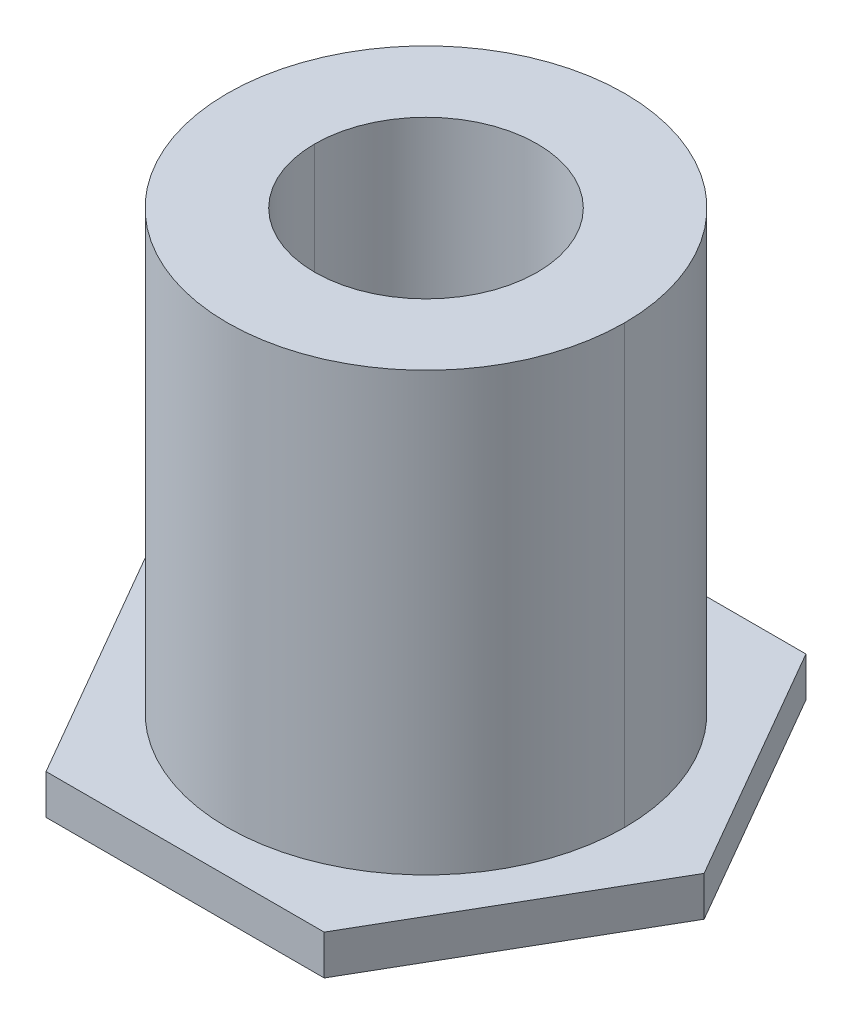
ISO-10303-21;
HEADER;
FILE_DESCRIPTION(('STEP AP214'),'2;1');
FILE_NAME('part.step','',(''),(''),'','','');
FILE_SCHEMA(('AUTOMOTIVE_DESIGN { 1 0 10303 214 1 1 1 1 }'));
ENDSEC;
DATA;
#1=APPLICATION_CONTEXT('core data for automotive mechanical design processes');
#2=APPLICATION_PROTOCOL_DEFINITION('international standard','automotive_design',2000,#1);
#3=PRODUCT_CONTEXT('',#1,'mechanical');
#4=PRODUCT('Part','Part','',(#3));
#5=PRODUCT_RELATED_PRODUCT_CATEGORY('part','',(#4));
#6=PRODUCT_DEFINITION_FORMATION('','',#4);
#7=PRODUCT_DEFINITION_CONTEXT('part definition',#1,'design');
#8=PRODUCT_DEFINITION('design','',#6,#7);
#9=PRODUCT_DEFINITION_SHAPE('','',#8);
#10=(LENGTH_UNIT() NAMED_UNIT(*) SI_UNIT(.MILLI.,.METRE.));
#11=(NAMED_UNIT(*) PLANE_ANGLE_UNIT() SI_UNIT($,.RADIAN.));
#12=(NAMED_UNIT(*) SI_UNIT($,.STERADIAN.) SOLID_ANGLE_UNIT());
#13=UNCERTAINTY_MEASURE_WITH_UNIT(LENGTH_MEASURE(1.E-05),#10,'distance_accuracy_value','');
#14=(GEOMETRIC_REPRESENTATION_CONTEXT(3) GLOBAL_UNCERTAINTY_ASSIGNED_CONTEXT((#13)) GLOBAL_UNIT_ASSIGNED_CONTEXT((#10,
#11,#12)) REPRESENTATION_CONTEXT('',''));
#15=CARTESIAN_POINT('',(0.,0.,0.));
#16=DIRECTION('',(0.,0.,1.));
#17=DIRECTION('',(1.,0.,0.));
#18=AXIS2_PLACEMENT_3D('',#15,#16,#17);
#19=CARTESIAN_POINT('',(0.,0.5,0.));
#20=DIRECTION('',(0.,1.,0.));
#21=DIRECTION('',(1.,0.,0.));
#22=AXIS2_PLACEMENT_3D('',#19,#20,#21);
#23=CYLINDRICAL_SURFACE('',#22,2.5);
#24=DIRECTION('',(0.,1.,0.));
#25=VECTOR('',#24,1.);
#26=CARTESIAN_POINT('',(2.5,0.5,0.));
#27=LINE('',#26,#25);
#28=CARTESIAN_POINT('',(2.5,0.5,0.));
#29=VERTEX_POINT('',#28);
#30=CARTESIAN_POINT('',(2.5,6.,0.));
#31=VERTEX_POINT('',#30);
#32=EDGE_CURVE('E20',#29,#31,#27,.T.);
#33=ORIENTED_EDGE('',*,*,#32,.F.);
#34=CARTESIAN_POINT('',(0.,0.5,0.));
#35=DIRECTION('',(0.,1.,0.));
#36=DIRECTION('',(1.,0.,0.));
#37=AXIS2_PLACEMENT_3D('',#34,#35,#36);
#38=CIRCLE('',#37,2.5);
#39=CARTESIAN_POINT('',(-2.5,0.5,0.));
#40=VERTEX_POINT('',#39);
#41=EDGE_CURVE('E132',#29,#40,#38,.T.);
#42=ORIENTED_EDGE('',*,*,#41,.T.);
#43=DIRECTION('',(0.,1.,0.));
#44=VECTOR('',#43,1.);
#45=CARTESIAN_POINT('',(-2.5,0.5,0.));
#46=LINE('',#45,#44);
#47=CARTESIAN_POINT('',(-2.5,6.,0.));
#48=VERTEX_POINT('',#47);
#49=EDGE_CURVE('E115',#40,#48,#46,.T.);
#50=ORIENTED_EDGE('',*,*,#49,.T.);
#51=CARTESIAN_POINT('',(0.,6.,0.));
#52=DIRECTION('',(0.,-1.,0.));
#53=DIRECTION('',(-1.,0.,0.));
#54=AXIS2_PLACEMENT_3D('',#51,#52,#53);
#55=CIRCLE('',#54,2.5);
#56=EDGE_CURVE('E110',#48,#31,#55,.T.);
#57=ORIENTED_EDGE('',*,*,#56,.T.);
#58=EDGE_LOOP('',(#33,#42,#50,#57));
#59=FACE_BOUND('',#58,.T.);
#60=ADVANCED_FACE('F16',(#59),#23,.T.);
#61=CARTESIAN_POINT('',(0.,0.5,0.));
#62=DIRECTION('',(0.,1.,0.));
#63=DIRECTION('',(1.,0.,0.));
#64=AXIS2_PLACEMENT_3D('',#61,#62,#63);
#65=CYLINDRICAL_SURFACE('',#64,1.4);
#66=DIRECTION('',(0.,1.,0.));
#67=VECTOR('',#66,1.);
#68=CARTESIAN_POINT('',(1.4,0.5,0.));
#69=LINE('',#68,#67);
#70=CARTESIAN_POINT('',(1.4,0.5,0.));
#71=VERTEX_POINT('',#70);
#72=CARTESIAN_POINT('',(1.4,6.,0.));
#73=VERTEX_POINT('',#72);
#74=EDGE_CURVE('E27',#71,#73,#69,.T.);
#75=ORIENTED_EDGE('',*,*,#74,.T.);
#76=CARTESIAN_POINT('',(0.,6.,0.));
#77=DIRECTION('',(0.,1.,0.));
#78=DIRECTION('',(-1.,0.,0.));
#79=AXIS2_PLACEMENT_3D('',#76,#77,#78);
#80=CIRCLE('',#79,1.4);
#81=CARTESIAN_POINT('',(-1.4,6.,0.));
#82=VERTEX_POINT('',#81);
#83=EDGE_CURVE('E182',#73,#82,#80,.T.);
#84=ORIENTED_EDGE('',*,*,#83,.T.);
#85=DIRECTION('',(0.,1.,0.));
#86=VECTOR('',#85,1.);
#87=CARTESIAN_POINT('',(-1.4,0.5,0.));
#88=LINE('',#87,#86);
#89=CARTESIAN_POINT('',(-1.4,0.5,0.));
#90=VERTEX_POINT('',#89);
#91=EDGE_CURVE('E11',#90,#82,#88,.T.);
#92=ORIENTED_EDGE('',*,*,#91,.F.);
#93=CARTESIAN_POINT('',(0.,0.5,0.));
#94=DIRECTION('',(0.,-1.,0.));
#95=DIRECTION('',(1.,0.,0.));
#96=AXIS2_PLACEMENT_3D('',#93,#94,#95);
#97=CIRCLE('',#96,1.4);
#98=EDGE_CURVE('E120',#90,#71,#97,.T.);
#99=ORIENTED_EDGE('',*,*,#98,.T.);
#100=EDGE_LOOP('',(#75,#84,#92,#99));
#101=FACE_BOUND('',#100,.T.);
#102=ADVANCED_FACE('F277',(#101),#65,.F.);
#103=CARTESIAN_POINT('',(0.,0.5,0.));
#104=DIRECTION('',(0.,1.,0.));
#105=DIRECTION('',(1.,0.,0.));
#106=AXIS2_PLACEMENT_3D('',#103,#104,#105);
#107=CYLINDRICAL_SURFACE('',#106,1.4);
#108=CARTESIAN_POINT('',(0.,6.,0.));
#109=DIRECTION('',(0.,1.,0.));
#110=DIRECTION('',(-1.,0.,0.));
#111=AXIS2_PLACEMENT_3D('',#108,#109,#110);
#112=CIRCLE('',#111,1.4);
#113=EDGE_CURVE('E119',#82,#73,#112,.T.);
#114=ORIENTED_EDGE('',*,*,#113,.T.);
#115=ORIENTED_EDGE('',*,*,#74,.F.);
#116=CARTESIAN_POINT('',(0.,0.5,0.));
#117=DIRECTION('',(0.,-1.,0.));
#118=DIRECTION('',(1.,0.,0.));
#119=AXIS2_PLACEMENT_3D('',#116,#117,#118);
#120=CIRCLE('',#119,1.4);
#121=EDGE_CURVE('E188',#71,#90,#120,.T.);
#122=ORIENTED_EDGE('',*,*,#121,.T.);
#123=ORIENTED_EDGE('',*,*,#91,.T.);
#124=EDGE_LOOP('',(#114,#115,#122,#123));
#125=FACE_BOUND('',#124,.T.);
#126=ADVANCED_FACE('F272',(#125),#107,.F.);
#127=CARTESIAN_POINT('',(0.,6.,0.));
#128=DIRECTION('',(0.,1.,0.));
#129=DIRECTION('',(1.,0.,0.));
#130=AXIS2_PLACEMENT_3D('',#127,#128,#129);
#131=PLANE('',#130);
#132=ORIENTED_EDGE('',*,*,#113,.F.);
#133=ORIENTED_EDGE('',*,*,#83,.F.);
#134=EDGE_LOOP('',(#132,#133));
#135=FACE_BOUND('',#134,.T.);
#136=CARTESIAN_POINT('',(0.,6.,0.));
#137=DIRECTION('',(0.,-1.,0.));
#138=DIRECTION('',(-1.,0.,0.));
#139=AXIS2_PLACEMENT_3D('',#136,#137,#138);
#140=CIRCLE('',#139,2.5);
#141=EDGE_CURVE('E122',#31,#48,#140,.T.);
#142=ORIENTED_EDGE('',*,*,#141,.F.);
#143=ORIENTED_EDGE('',*,*,#56,.F.);
#144=EDGE_LOOP('',(#142,#143));
#145=FACE_BOUND('',#144,.T.);
#146=ADVANCED_FACE('F123',(#135,#145),#131,.T.);
#147=CARTESIAN_POINT('',(0.,0.5,0.));
#148=DIRECTION('',(0.,1.,0.));
#149=DIRECTION('',(1.,0.,0.));
#150=AXIS2_PLACEMENT_3D('',#147,#148,#149);
#151=PLANE('',#150);
#152=ORIENTED_EDGE('',*,*,#121,.F.);
#153=ORIENTED_EDGE('',*,*,#98,.F.);
#154=EDGE_LOOP('',(#152,#153));
#155=FACE_BOUND('',#154,.T.);
#156=ADVANCED_FACE('F288',(#155),#151,.T.);
#157=CARTESIAN_POINT('',(0.,0.5,0.));
#158=DIRECTION('',(0.,1.,0.));
#159=DIRECTION('',(1.,0.,0.));
#160=AXIS2_PLACEMENT_3D('',#157,#158,#159);
#161=CYLINDRICAL_SURFACE('',#160,2.5);
#162=CARTESIAN_POINT('',(0.,0.5,0.));
#163=DIRECTION('',(0.,1.,0.));
#164=DIRECTION('',(1.,0.,0.));
#165=AXIS2_PLACEMENT_3D('',#162,#163,#164);
#166=CIRCLE('',#165,2.5);
#167=EDGE_CURVE('E130',#40,#29,#166,.T.);
#168=ORIENTED_EDGE('',*,*,#167,.T.);
#169=ORIENTED_EDGE('',*,*,#32,.T.);
#170=ORIENTED_EDGE('',*,*,#141,.T.);
#171=ORIENTED_EDGE('',*,*,#49,.F.);
#172=EDGE_LOOP('',(#168,#169,#170,#171));
#173=FACE_BOUND('',#172,.T.);
#174=ADVANCED_FACE('F128',(#173),#161,.T.);
#175=CARTESIAN_POINT('',(0.,0.5,0.));
#176=DIRECTION('',(0.,1.,0.));
#177=DIRECTION('',(1.,0.,0.));
#178=AXIS2_PLACEMENT_3D('',#175,#176,#177);
#179=PLANE('',#178);
#180=ORIENTED_EDGE('',*,*,#167,.F.);
#181=ORIENTED_EDGE('',*,*,#41,.F.);
#182=EDGE_LOOP('',(#180,#181));
#183=FACE_BOUND('',#182,.T.);
#184=DIRECTION('',(1.,0.,0.));
#185=VECTOR('',#184,1.);
#186=CARTESIAN_POINT('',(-1.75,0.5,-3.031088913246));
#187=LINE('',#186,#185);
#188=CARTESIAN_POINT('',(-1.75,0.5,-3.031088913246));
#189=VERTEX_POINT('',#188);
#190=CARTESIAN_POINT('',(1.74999999999983,0.5,-3.031088913246));
#191=VERTEX_POINT('',#190);
#192=EDGE_CURVE('E201',#189,#191,#187,.T.);
#193=ORIENTED_EDGE('',*,*,#192,.F.);
#194=DIRECTION('',(0.500000000000017,0.,-0.866025403784429));
#195=VECTOR('',#194,1.);
#196=CARTESIAN_POINT('',(-3.50000000000017,0.5,-3.00122306251334E-13));
#197=LINE('',#196,#195);
#198=CARTESIAN_POINT('',(-3.50000000000009,0.5,-1.50043637228728E-13));
#199=VERTEX_POINT('',#198);
#200=EDGE_CURVE('E141',#199,#189,#197,.T.);
#201=ORIENTED_EDGE('',*,*,#200,.F.);
#202=DIRECTION('',(-0.500000000000017,0.,-0.866025403784429));
#203=VECTOR('',#202,1.);
#204=CARTESIAN_POINT('',(-1.74999999999965,0.5,3.031088913246));
#205=LINE('',#204,#203);
#206=CARTESIAN_POINT('',(-1.74999999999983,0.5,3.031088913246));
#207=VERTEX_POINT('',#206);
#208=EDGE_CURVE('E163',#207,#199,#205,.T.);
#209=ORIENTED_EDGE('',*,*,#208,.F.);
#210=DIRECTION('',(-1.,0.,0.));
#211=VECTOR('',#210,1.);
#212=CARTESIAN_POINT('',(1.75,0.5,3.031088913246));
#213=LINE('',#212,#211);
#214=CARTESIAN_POINT('',(1.75,0.5,3.031088913246));
#215=VERTEX_POINT('',#214);
#216=EDGE_CURVE('E152',#215,#207,#213,.T.);
#217=ORIENTED_EDGE('',*,*,#216,.F.);
#218=DIRECTION('',(-0.500000000000017,0.,0.866025403784429));
#219=VECTOR('',#218,1.);
#220=CARTESIAN_POINT('',(3.50000000000017,0.5,3.00122306251334E-13));
#221=LINE('',#220,#219);
#222=CARTESIAN_POINT('',(3.50000000000009,0.5,1.50043637228728E-13));
#223=VERTEX_POINT('',#222);
#224=EDGE_CURVE('E165',#223,#215,#221,.T.);
#225=ORIENTED_EDGE('',*,*,#224,.F.);
#226=DIRECTION('',(0.500000000000017,0.,0.866025403784429));
#227=VECTOR('',#226,1.);
#228=CARTESIAN_POINT('',(1.74999999999965,0.5,-3.031088913246));
#229=LINE('',#228,#227);
#230=EDGE_CURVE('E183',#191,#223,#229,.T.);
#231=ORIENTED_EDGE('',*,*,#230,.F.);
#232=EDGE_LOOP('',(#193,#201,#209,#217,#225,#231));
#233=FACE_BOUND('',#232,.T.);
#234=ADVANCED_FACE('F248',(#183,#233),#179,.T.);
#235=CARTESIAN_POINT('',(-1.75,0.,-3.031088913246));
#236=DIRECTION('',(-0.866025403784429,0.,-0.500000000000017));
#237=DIRECTION('',(-0.500000000000017,0.,0.866025403784429));
#238=AXIS2_PLACEMENT_3D('',#235,#236,#237);
#239=PLANE('',#238);
#240=DIRECTION('',(-0.500000000000017,0.,0.866025403784429));
#241=VECTOR('',#240,1.);
#242=CARTESIAN_POINT('',(-1.75,0.,-3.031088913246));
#243=LINE('',#242,#241);
#244=CARTESIAN_POINT('',(-1.75,0.,-3.031088913246));
#245=VERTEX_POINT('',#244);
#246=CARTESIAN_POINT('',(-3.50000000000009,0.,-1.50043637228728E-13));
#247=VERTEX_POINT('',#246);
#248=EDGE_CURVE('E202',#245,#247,#243,.T.);
#249=ORIENTED_EDGE('',*,*,#248,.T.);
#250=DIRECTION('',(0.,-1.,0.));
#251=VECTOR('',#250,1.);
#252=CARTESIAN_POINT('',(-3.50000000000026,0.5,-1.50546242139171E-13));
#253=LINE('',#252,#251);
#254=EDGE_CURVE('E195',#199,#247,#253,.T.);
#255=ORIENTED_EDGE('',*,*,#254,.F.);
#256=ORIENTED_EDGE('',*,*,#200,.T.);
#257=DIRECTION('',(0.,-1.,0.));
#258=VECTOR('',#257,1.);
#259=CARTESIAN_POINT('',(-1.75,0.5,-3.031088913246));
#260=LINE('',#259,#258);
#261=EDGE_CURVE('E198',#189,#245,#260,.T.);
#262=ORIENTED_EDGE('',*,*,#261,.T.);
#263=EDGE_LOOP('',(#249,#255,#256,#262));
#264=FACE_BOUND('',#263,.T.);
#265=ADVANCED_FACE('F236',(#264),#239,.T.);
#266=CARTESIAN_POINT('',(-3.5,0.,0.));
#267=DIRECTION('',(-0.866025403784429,0.,0.500000000000017));
#268=DIRECTION('',(0.,1.,0.));
#269=AXIS2_PLACEMENT_3D('',#266,#267,#268);
#270=PLANE('',#269);
#271=DIRECTION('',(0.500000000000017,0.,0.866025403784429));
#272=VECTOR('',#271,1.);
#273=CARTESIAN_POINT('',(-3.50000000000017,0.,-3.00122306251334E-13));
#274=LINE('',#273,#272);
#275=CARTESIAN_POINT('',(-1.74999999999983,0.,3.031088913246));
#276=VERTEX_POINT('',#275);
#277=EDGE_CURVE('E150',#247,#276,#274,.T.);
#278=ORIENTED_EDGE('',*,*,#277,.T.);
#279=DIRECTION('',(0.,-1.,0.));
#280=VECTOR('',#279,1.);
#281=CARTESIAN_POINT('',(-1.74999999999974,0.5,3.03108891324585));
#282=LINE('',#281,#280);
#283=EDGE_CURVE('E155',#207,#276,#282,.T.);
#284=ORIENTED_EDGE('',*,*,#283,.F.);
#285=ORIENTED_EDGE('',*,*,#208,.T.);
#286=ORIENTED_EDGE('',*,*,#254,.T.);
#287=EDGE_LOOP('',(#278,#284,#285,#286));
#288=FACE_BOUND('',#287,.T.);
#289=ADVANCED_FACE('F231',(#288),#270,.T.);
#290=CARTESIAN_POINT('',(-1.75,0.,3.031088913246));
#291=DIRECTION('',(0.,0.,1.));
#292=DIRECTION('',(1.,0.,0.));
#293=AXIS2_PLACEMENT_3D('',#290,#291,#292);
#294=PLANE('',#293);
#295=DIRECTION('',(-1.,0.,0.));
#296=VECTOR('',#295,1.);
#297=CARTESIAN_POINT('',(1.75,0.,3.031088913246));
#298=LINE('',#297,#296);
#299=CARTESIAN_POINT('',(1.75,0.,3.031088913246));
#300=VERTEX_POINT('',#299);
#301=EDGE_CURVE('E147',#300,#276,#298,.T.);
#302=ORIENTED_EDGE('',*,*,#301,.F.);
#303=DIRECTION('',(0.,-1.,0.));
#304=VECTOR('',#303,1.);
#305=CARTESIAN_POINT('',(1.75,0.5,3.031088913246));
#306=LINE('',#305,#304);
#307=EDGE_CURVE('E156',#215,#300,#306,.T.);
#308=ORIENTED_EDGE('',*,*,#307,.F.);
#309=ORIENTED_EDGE('',*,*,#216,.T.);
#310=ORIENTED_EDGE('',*,*,#283,.T.);
#311=EDGE_LOOP('',(#302,#308,#309,#310));
#312=FACE_BOUND('',#311,.T.);
#313=ADVANCED_FACE('F244',(#312),#294,.T.);
#314=CARTESIAN_POINT('',(1.75,0.,3.031088913246));
#315=DIRECTION('',(0.866025403784429,0.,0.500000000000017));
#316=DIRECTION('',(0.,-1.,0.));
#317=AXIS2_PLACEMENT_3D('',#314,#315,#316);
#318=PLANE('',#317);
#319=DIRECTION('',(0.500000000000017,0.,-0.866025403784429));
#320=VECTOR('',#319,1.);
#321=CARTESIAN_POINT('',(1.75,0.,3.031088913246));
#322=LINE('',#321,#320);
#323=CARTESIAN_POINT('',(3.50000000000009,0.,1.50043637228728E-13));
#324=VERTEX_POINT('',#323);
#325=EDGE_CURVE('E151',#300,#324,#322,.T.);
#326=ORIENTED_EDGE('',*,*,#325,.T.);
#327=DIRECTION('',(0.,-1.,0.));
#328=VECTOR('',#327,1.);
#329=CARTESIAN_POINT('',(3.50000000000026,0.5,1.50546242139171E-13));
#330=LINE('',#329,#328);
#331=EDGE_CURVE('E174',#223,#324,#330,.T.);
#332=ORIENTED_EDGE('',*,*,#331,.F.);
#333=ORIENTED_EDGE('',*,*,#224,.T.);
#334=ORIENTED_EDGE('',*,*,#307,.T.);
#335=EDGE_LOOP('',(#326,#332,#333,#334));
#336=FACE_BOUND('',#335,.T.);
#337=ADVANCED_FACE('F18',(#336),#318,.T.);
#338=CARTESIAN_POINT('',(3.5,0.,0.));
#339=DIRECTION('',(0.866025403784429,0.,-0.500000000000017));
#340=DIRECTION('',(0.,-1.,0.));
#341=AXIS2_PLACEMENT_3D('',#338,#339,#340);
#342=PLANE('',#341);
#343=DIRECTION('',(-0.500000000000017,0.,-0.866025403784429));
#344=VECTOR('',#343,1.);
#345=CARTESIAN_POINT('',(3.50000000000017,0.,3.00122306251334E-13));
#346=LINE('',#345,#344);
#347=CARTESIAN_POINT('',(1.74999999999965,0.,-3.031088913246));
#348=VERTEX_POINT('',#347);
#349=EDGE_CURVE('E178',#324,#348,#346,.T.);
#350=ORIENTED_EDGE('',*,*,#349,.T.);
#351=DIRECTION('',(0.,-1.,0.));
#352=VECTOR('',#351,1.);
#353=CARTESIAN_POINT('',(1.74999999999974,0.5,-3.03108891324585));
#354=LINE('',#353,#352);
#355=EDGE_CURVE('E187',#191,#348,#354,.T.);
#356=ORIENTED_EDGE('',*,*,#355,.F.);
#357=ORIENTED_EDGE('',*,*,#230,.T.);
#358=ORIENTED_EDGE('',*,*,#331,.T.);
#359=EDGE_LOOP('',(#350,#356,#357,#358));
#360=FACE_BOUND('',#359,.T.);
#361=ADVANCED_FACE('F260',(#360),#342,.T.);
#362=CARTESIAN_POINT('',(1.75,0.,-3.031088913246));
#363=DIRECTION('',(0.,0.,-1.));
#364=DIRECTION('',(0.,-1.,0.));
#365=AXIS2_PLACEMENT_3D('',#362,#363,#364);
#366=PLANE('',#365);
#367=DIRECTION('',(1.,0.,0.));
#368=VECTOR('',#367,1.);
#369=CARTESIAN_POINT('',(-1.75,0.,-3.031088913246));
#370=LINE('',#369,#368);
#371=EDGE_CURVE('E145',#245,#348,#370,.T.);
#372=ORIENTED_EDGE('',*,*,#371,.F.);
#373=ORIENTED_EDGE('',*,*,#261,.F.);
#374=ORIENTED_EDGE('',*,*,#192,.T.);
#375=ORIENTED_EDGE('',*,*,#355,.T.);
#376=EDGE_LOOP('',(#372,#373,#374,#375));
#377=FACE_BOUND('',#376,.T.);
#378=ADVANCED_FACE('F315',(#377),#366,.T.);
#379=CARTESIAN_POINT('',(0.,0.,0.));
#380=DIRECTION('',(0.,1.,0.));
#381=DIRECTION('',(1.,0.,0.));
#382=AXIS2_PLACEMENT_3D('',#379,#380,#381);
#383=PLANE('',#382);
#384=ORIENTED_EDGE('',*,*,#371,.T.);
#385=ORIENTED_EDGE('',*,*,#349,.F.);
#386=ORIENTED_EDGE('',*,*,#325,.F.);
#387=ORIENTED_EDGE('',*,*,#301,.T.);
#388=ORIENTED_EDGE('',*,*,#277,.F.);
#389=ORIENTED_EDGE('',*,*,#248,.F.);
#390=EDGE_LOOP('',(#384,#385,#386,#387,#388,#389));
#391=FACE_BOUND('',#390,.T.);
#392=ADVANCED_FACE('F241',(#391),#383,.F.);
#393=CLOSED_SHELL('',(#60,#102,#126,#146,#156,#174,#234,#265,#289,#313,#337,#361,#378,#392));
#394=MANIFOLD_SOLID_BREP('B1',#393);
#395=ADVANCED_BREP_SHAPE_REPRESENTATION('',(#18,#394),#14);
#396=SHAPE_DEFINITION_REPRESENTATION(#9,#395);
ENDSEC;
END-ISO-10303-21;
